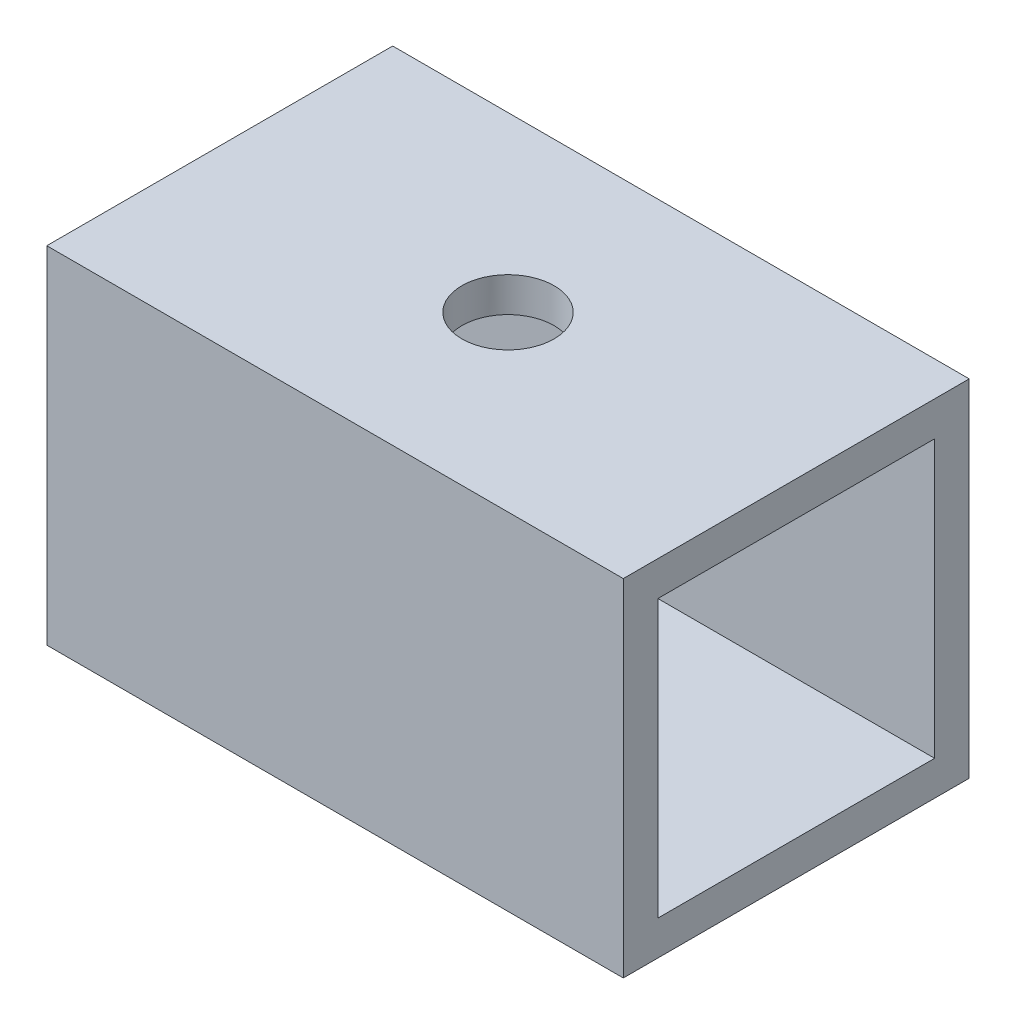
ISO-10303-21;
HEADER;
FILE_DESCRIPTION(('STEP AP214'),'2;1');
FILE_NAME('part.step','',(''),(''),'','','');
FILE_SCHEMA(('AUTOMOTIVE_DESIGN { 1 0 10303 214 1 1 1 1 }'));
ENDSEC;
DATA;
#1=APPLICATION_CONTEXT('core data for automotive mechanical design processes');
#2=APPLICATION_PROTOCOL_DEFINITION('international standard','automotive_design',2000,#1);
#3=PRODUCT_CONTEXT('',#1,'mechanical');
#4=PRODUCT('Part','Part','',(#3));
#5=PRODUCT_RELATED_PRODUCT_CATEGORY('part','',(#4));
#6=PRODUCT_DEFINITION_FORMATION('','',#4);
#7=PRODUCT_DEFINITION_CONTEXT('part definition',#1,'design');
#8=PRODUCT_DEFINITION('design','',#6,#7);
#9=PRODUCT_DEFINITION_SHAPE('','',#8);
#10=(LENGTH_UNIT() NAMED_UNIT(*) SI_UNIT(.MILLI.,.METRE.));
#11=(NAMED_UNIT(*) PLANE_ANGLE_UNIT() SI_UNIT($,.RADIAN.));
#12=(NAMED_UNIT(*) SI_UNIT($,.STERADIAN.) SOLID_ANGLE_UNIT());
#13=UNCERTAINTY_MEASURE_WITH_UNIT(LENGTH_MEASURE(1.E-05),#10,'distance_accuracy_value','');
#14=(GEOMETRIC_REPRESENTATION_CONTEXT(3) GLOBAL_UNCERTAINTY_ASSIGNED_CONTEXT((#13)) GLOBAL_UNIT_ASSIGNED_CONTEXT((#10,
#11,#12)) REPRESENTATION_CONTEXT('',''));
#15=CARTESIAN_POINT('',(0.,0.,0.));
#16=DIRECTION('',(0.,0.,1.));
#17=DIRECTION('',(1.,0.,0.));
#18=AXIS2_PLACEMENT_3D('',#15,#16,#17);
#19=CARTESIAN_POINT('',(25.,0.,0.));
#20=DIRECTION('',(1.,0.,0.));
#21=DIRECTION('',(0.,0.,-1.));
#22=AXIS2_PLACEMENT_3D('',#19,#20,#21);
#23=PLANE('',#22);
#24=DIRECTION('',(0.,1.,0.));
#25=VECTOR('',#24,1.);
#26=CARTESIAN_POINT('',(25.,7.5,-7.5));
#27=LINE('',#26,#25);
#28=CARTESIAN_POINT('',(25.,-7.5,-7.5));
#29=VERTEX_POINT('',#28);
#30=CARTESIAN_POINT('',(25.,7.5,-7.5));
#31=VERTEX_POINT('',#30);
#32=EDGE_CURVE('E137',#29,#31,#27,.T.);
#33=ORIENTED_EDGE('',*,*,#32,.T.);
#34=DIRECTION('',(0.,0.,1.));
#35=VECTOR('',#34,1.);
#36=CARTESIAN_POINT('',(25.,7.5,7.5));
#37=LINE('',#36,#35);
#38=CARTESIAN_POINT('',(25.,7.5,7.5));
#39=VERTEX_POINT('',#38);
#40=EDGE_CURVE('E140',#31,#39,#37,.T.);
#41=ORIENTED_EDGE('',*,*,#40,.T.);
#42=DIRECTION('',(0.,-1.,0.));
#43=VECTOR('',#42,1.);
#44=CARTESIAN_POINT('',(25.,7.5,7.5));
#45=LINE('',#44,#43);
#46=CARTESIAN_POINT('',(25.,-7.5,7.5));
#47=VERTEX_POINT('',#46);
#48=EDGE_CURVE('E143',#39,#47,#45,.T.);
#49=ORIENTED_EDGE('',*,*,#48,.T.);
#50=DIRECTION('',(0.,0.,-1.));
#51=VECTOR('',#50,1.);
#52=CARTESIAN_POINT('',(25.,-7.5,7.5));
#53=LINE('',#52,#51);
#54=EDGE_CURVE('E145',#47,#29,#53,.T.);
#55=ORIENTED_EDGE('',*,*,#54,.T.);
#56=EDGE_LOOP('',(#33,#41,#49,#55));
#57=FACE_BOUND('',#56,.T.);
#58=DIRECTION('',(0.,0.,-1.));
#59=VECTOR('',#58,1.);
#60=CARTESIAN_POINT('',(25.,-6.,6.));
#61=LINE('',#60,#59);
#62=CARTESIAN_POINT('',(25.,-6.,6.));
#63=VERTEX_POINT('',#62);
#64=CARTESIAN_POINT('',(25.,-6.,-6.));
#65=VERTEX_POINT('',#64);
#66=EDGE_CURVE('E107',#63,#65,#61,.T.);
#67=ORIENTED_EDGE('',*,*,#66,.F.);
#68=DIRECTION('',(0.,-1.,0.));
#69=VECTOR('',#68,1.);
#70=CARTESIAN_POINT('',(25.,6.,6.));
#71=LINE('',#70,#69);
#72=CARTESIAN_POINT('',(25.,6.,6.));
#73=VERTEX_POINT('',#72);
#74=EDGE_CURVE('E99',#73,#63,#71,.T.);
#75=ORIENTED_EDGE('',*,*,#74,.F.);
#76=DIRECTION('',(0.,0.,1.));
#77=VECTOR('',#76,1.);
#78=CARTESIAN_POINT('',(25.,6.,6.));
#79=LINE('',#78,#77);
#80=CARTESIAN_POINT('',(25.,6.,-6.));
#81=VERTEX_POINT('',#80);
#82=EDGE_CURVE('E121',#81,#73,#79,.T.);
#83=ORIENTED_EDGE('',*,*,#82,.F.);
#84=DIRECTION('',(0.,1.,0.));
#85=VECTOR('',#84,1.);
#86=CARTESIAN_POINT('',(25.,6.,-6.));
#87=LINE('',#86,#85);
#88=EDGE_CURVE('E119',#65,#81,#87,.T.);
#89=ORIENTED_EDGE('',*,*,#88,.F.);
#90=EDGE_LOOP('',(#67,#75,#83,#89));
#91=FACE_BOUND('',#90,.T.);
#92=ADVANCED_FACE('F33',(#57,#91),#23,.T.);
#93=CARTESIAN_POINT('',(0.,0.,0.));
#94=DIRECTION('',(1.,0.,0.));
#95=DIRECTION('',(0.,0.,-1.));
#96=AXIS2_PLACEMENT_3D('',#93,#94,#95);
#97=PLANE('',#96);
#98=DIRECTION('',(0.,1.,0.));
#99=VECTOR('',#98,1.);
#100=CARTESIAN_POINT('',(0.,7.5,-7.5));
#101=LINE('',#100,#99);
#102=CARTESIAN_POINT('',(0.,-7.5,-7.5));
#103=VERTEX_POINT('',#102);
#104=CARTESIAN_POINT('',(0.,7.5,-7.5));
#105=VERTEX_POINT('',#104);
#106=EDGE_CURVE('E115',#103,#105,#101,.T.);
#107=ORIENTED_EDGE('',*,*,#106,.F.);
#108=DIRECTION('',(0.,0.,-1.));
#109=VECTOR('',#108,1.);
#110=CARTESIAN_POINT('',(0.,-7.5,7.5));
#111=LINE('',#110,#109);
#112=CARTESIAN_POINT('',(0.,-7.5,7.5));
#113=VERTEX_POINT('',#112);
#114=EDGE_CURVE('E141',#113,#103,#111,.T.);
#115=ORIENTED_EDGE('',*,*,#114,.F.);
#116=DIRECTION('',(0.,-1.,0.));
#117=VECTOR('',#116,1.);
#118=CARTESIAN_POINT('',(0.,7.5,7.5));
#119=LINE('',#118,#117);
#120=CARTESIAN_POINT('',(0.,7.5,7.5));
#121=VERTEX_POINT('',#120);
#122=EDGE_CURVE('E152',#121,#113,#119,.T.);
#123=ORIENTED_EDGE('',*,*,#122,.F.);
#124=DIRECTION('',(0.,0.,1.));
#125=VECTOR('',#124,1.);
#126=CARTESIAN_POINT('',(0.,7.5,7.5));
#127=LINE('',#126,#125);
#128=EDGE_CURVE('E150',#105,#121,#127,.T.);
#129=ORIENTED_EDGE('',*,*,#128,.F.);
#130=EDGE_LOOP('',(#107,#115,#123,#129));
#131=FACE_BOUND('',#130,.T.);
#132=DIRECTION('',(0.,-1.,0.));
#133=VECTOR('',#132,1.);
#134=CARTESIAN_POINT('',(0.,6.,6.));
#135=LINE('',#134,#133);
#136=CARTESIAN_POINT('',(0.,6.,6.));
#137=VERTEX_POINT('',#136);
#138=CARTESIAN_POINT('',(0.,-6.,6.));
#139=VERTEX_POINT('',#138);
#140=EDGE_CURVE('E57',#137,#139,#135,.T.);
#141=ORIENTED_EDGE('',*,*,#140,.T.);
#142=DIRECTION('',(0.,0.,-1.));
#143=VECTOR('',#142,1.);
#144=CARTESIAN_POINT('',(0.,-6.,6.));
#145=LINE('',#144,#143);
#146=CARTESIAN_POINT('',(0.,-6.,-6.));
#147=VERTEX_POINT('',#146);
#148=EDGE_CURVE('E114',#139,#147,#145,.T.);
#149=ORIENTED_EDGE('',*,*,#148,.T.);
#150=DIRECTION('',(0.,1.,0.));
#151=VECTOR('',#150,1.);
#152=CARTESIAN_POINT('',(0.,6.,-6.));
#153=LINE('',#152,#151);
#154=CARTESIAN_POINT('',(0.,6.,-6.));
#155=VERTEX_POINT('',#154);
#156=EDGE_CURVE('E129',#147,#155,#153,.T.);
#157=ORIENTED_EDGE('',*,*,#156,.T.);
#158=DIRECTION('',(0.,0.,1.));
#159=VECTOR('',#158,1.);
#160=CARTESIAN_POINT('',(0.,6.,6.));
#161=LINE('',#160,#159);
#162=EDGE_CURVE('E108',#155,#137,#161,.T.);
#163=ORIENTED_EDGE('',*,*,#162,.T.);
#164=EDGE_LOOP('',(#141,#149,#157,#163));
#165=FACE_BOUND('',#164,.T.);
#166=ADVANCED_FACE('F171',(#131,#165),#97,.F.);
#167=CARTESIAN_POINT('',(25.,7.5,-7.5));
#168=DIRECTION('',(0.,0.,1.));
#169=DIRECTION('',(0.,-1.,0.));
#170=AXIS2_PLACEMENT_3D('',#167,#168,#169);
#171=PLANE('',#170);
#172=ORIENTED_EDGE('',*,*,#106,.T.);
#173=DIRECTION('',(-1.,0.,0.));
#174=VECTOR('',#173,1.);
#175=CARTESIAN_POINT('',(25.,7.5,-7.5));
#176=LINE('',#175,#174);
#177=EDGE_CURVE('E11',#31,#105,#176,.T.);
#178=ORIENTED_EDGE('',*,*,#177,.F.);
#179=ORIENTED_EDGE('',*,*,#32,.F.);
#180=DIRECTION('',(-1.,0.,0.));
#181=VECTOR('',#180,1.);
#182=CARTESIAN_POINT('',(25.,-7.5,-7.5));
#183=LINE('',#182,#181);
#184=EDGE_CURVE('E147',#29,#103,#183,.T.);
#185=ORIENTED_EDGE('',*,*,#184,.T.);
#186=EDGE_LOOP('',(#172,#178,#179,#185));
#187=FACE_BOUND('',#186,.T.);
#188=ADVANCED_FACE('F35',(#187),#171,.F.);
#189=CARTESIAN_POINT('',(25.,7.5,7.5));
#190=DIRECTION('',(0.,-1.,0.));
#191=DIRECTION('',(0.,0.,-1.));
#192=AXIS2_PLACEMENT_3D('',#189,#190,#191);
#193=PLANE('',#192);
#194=CARTESIAN_POINT('',(12.5,7.5,0.));
#195=DIRECTION('',(0.,1.,0.));
#196=DIRECTION('',(0.,0.,1.));
#197=AXIS2_PLACEMENT_3D('',#194,#195,#196);
#198=CIRCLE('',#197,2.);
#199=CARTESIAN_POINT('',(12.5,7.5,2.));
#200=VERTEX_POINT('',#199);
#201=EDGE_CURVE('E208',#200,#200,#198,.T.);
#202=ORIENTED_EDGE('',*,*,#201,.F.);
#203=EDGE_LOOP('',(#202));
#204=FACE_BOUND('',#203,.T.);
#205=ORIENTED_EDGE('',*,*,#128,.T.);
#206=DIRECTION('',(-1.,0.,0.));
#207=VECTOR('',#206,1.);
#208=CARTESIAN_POINT('',(25.,7.5,7.5));
#209=LINE('',#208,#207);
#210=EDGE_CURVE('E42',#39,#121,#209,.T.);
#211=ORIENTED_EDGE('',*,*,#210,.F.);
#212=ORIENTED_EDGE('',*,*,#40,.F.);
#213=ORIENTED_EDGE('',*,*,#177,.T.);
#214=EDGE_LOOP('',(#205,#211,#212,#213));
#215=FACE_BOUND('',#214,.T.);
#216=ADVANCED_FACE('F181',(#204,#215),#193,.F.);
#217=CARTESIAN_POINT('',(25.,7.5,7.5));
#218=DIRECTION('',(0.,0.,-1.));
#219=DIRECTION('',(0.,1.,0.));
#220=AXIS2_PLACEMENT_3D('',#217,#218,#219);
#221=PLANE('',#220);
#222=ORIENTED_EDGE('',*,*,#122,.T.);
#223=DIRECTION('',(-1.,0.,0.));
#224=VECTOR('',#223,1.);
#225=CARTESIAN_POINT('',(25.,-7.5,7.5));
#226=LINE('',#225,#224);
#227=EDGE_CURVE('E157',#47,#113,#226,.T.);
#228=ORIENTED_EDGE('',*,*,#227,.F.);
#229=ORIENTED_EDGE('',*,*,#48,.F.);
#230=ORIENTED_EDGE('',*,*,#210,.T.);
#231=EDGE_LOOP('',(#222,#228,#229,#230));
#232=FACE_BOUND('',#231,.T.);
#233=ADVANCED_FACE('F165',(#232),#221,.F.);
#234=CARTESIAN_POINT('',(25.,-7.5,7.5));
#235=DIRECTION('',(0.,1.,0.));
#236=DIRECTION('',(0.,0.,1.));
#237=AXIS2_PLACEMENT_3D('',#234,#235,#236);
#238=PLANE('',#237);
#239=CARTESIAN_POINT('',(12.5,-7.5,0.));
#240=DIRECTION('',(0.,1.,0.));
#241=DIRECTION('',(0.,0.,1.));
#242=AXIS2_PLACEMENT_3D('',#239,#240,#241);
#243=CIRCLE('',#242,2.);
#244=CARTESIAN_POINT('',(12.5,-7.5,2.));
#245=VERTEX_POINT('',#244);
#246=EDGE_CURVE('E206',#245,#245,#243,.T.);
#247=ORIENTED_EDGE('',*,*,#246,.T.);
#248=EDGE_LOOP('',(#247));
#249=FACE_BOUND('',#248,.T.);
#250=ORIENTED_EDGE('',*,*,#114,.T.);
#251=ORIENTED_EDGE('',*,*,#184,.F.);
#252=ORIENTED_EDGE('',*,*,#54,.F.);
#253=ORIENTED_EDGE('',*,*,#227,.T.);
#254=EDGE_LOOP('',(#250,#251,#252,#253));
#255=FACE_BOUND('',#254,.T.);
#256=ADVANCED_FACE('F175',(#249,#255),#238,.F.);
#257=CARTESIAN_POINT('',(25.,6.,6.));
#258=DIRECTION('',(0.,0.,-1.));
#259=DIRECTION('',(0.,1.,0.));
#260=AXIS2_PLACEMENT_3D('',#257,#258,#259);
#261=PLANE('',#260);
#262=ORIENTED_EDGE('',*,*,#140,.F.);
#263=DIRECTION('',(-1.,0.,0.));
#264=VECTOR('',#263,1.);
#265=CARTESIAN_POINT('',(25.,6.,6.));
#266=LINE('',#265,#264);
#267=EDGE_CURVE('E103',#73,#137,#266,.T.);
#268=ORIENTED_EDGE('',*,*,#267,.F.);
#269=ORIENTED_EDGE('',*,*,#74,.T.);
#270=DIRECTION('',(-1.,0.,0.));
#271=VECTOR('',#270,1.);
#272=CARTESIAN_POINT('',(25.,-6.,6.));
#273=LINE('',#272,#271);
#274=EDGE_CURVE('E102',#63,#139,#273,.T.);
#275=ORIENTED_EDGE('',*,*,#274,.T.);
#276=EDGE_LOOP('',(#262,#268,#269,#275));
#277=FACE_BOUND('',#276,.T.);
#278=ADVANCED_FACE('F101',(#277),#261,.T.);
#279=CARTESIAN_POINT('',(25.,-6.,6.));
#280=DIRECTION('',(0.,1.,0.));
#281=DIRECTION('',(0.,0.,1.));
#282=AXIS2_PLACEMENT_3D('',#279,#280,#281);
#283=PLANE('',#282);
#284=CARTESIAN_POINT('',(12.5,-6.,0.));
#285=DIRECTION('',(0.,1.,0.));
#286=DIRECTION('',(0.,0.,1.));
#287=AXIS2_PLACEMENT_3D('',#284,#285,#286);
#288=CIRCLE('',#287,2.);
#289=CARTESIAN_POINT('',(12.5,-6.,2.));
#290=VERTEX_POINT('',#289);
#291=EDGE_CURVE('E127',#290,#290,#288,.T.);
#292=ORIENTED_EDGE('',*,*,#291,.F.);
#293=EDGE_LOOP('',(#292));
#294=FACE_BOUND('',#293,.T.);
#295=ORIENTED_EDGE('',*,*,#148,.F.);
#296=ORIENTED_EDGE('',*,*,#274,.F.);
#297=ORIENTED_EDGE('',*,*,#66,.T.);
#298=DIRECTION('',(-1.,0.,0.));
#299=VECTOR('',#298,1.);
#300=CARTESIAN_POINT('',(25.,-6.,-6.));
#301=LINE('',#300,#299);
#302=EDGE_CURVE('E116',#65,#147,#301,.T.);
#303=ORIENTED_EDGE('',*,*,#302,.T.);
#304=EDGE_LOOP('',(#295,#296,#297,#303));
#305=FACE_BOUND('',#304,.T.);
#306=ADVANCED_FACE('F111',(#294,#305),#283,.T.);
#307=CARTESIAN_POINT('',(25.,6.,-6.));
#308=DIRECTION('',(0.,0.,1.));
#309=DIRECTION('',(0.,-1.,0.));
#310=AXIS2_PLACEMENT_3D('',#307,#308,#309);
#311=PLANE('',#310);
#312=ORIENTED_EDGE('',*,*,#156,.F.);
#313=ORIENTED_EDGE('',*,*,#302,.F.);
#314=ORIENTED_EDGE('',*,*,#88,.T.);
#315=DIRECTION('',(-1.,0.,0.));
#316=VECTOR('',#315,1.);
#317=CARTESIAN_POINT('',(25.,6.,-6.));
#318=LINE('',#317,#316);
#319=EDGE_CURVE('E49',#81,#155,#318,.T.);
#320=ORIENTED_EDGE('',*,*,#319,.T.);
#321=EDGE_LOOP('',(#312,#313,#314,#320));
#322=FACE_BOUND('',#321,.T.);
#323=ADVANCED_FACE('F219',(#322),#311,.T.);
#324=CARTESIAN_POINT('',(25.,6.,6.));
#325=DIRECTION('',(0.,-1.,0.));
#326=DIRECTION('',(0.,0.,-1.));
#327=AXIS2_PLACEMENT_3D('',#324,#325,#326);
#328=PLANE('',#327);
#329=CARTESIAN_POINT('',(12.5,6.,0.));
#330=DIRECTION('',(0.,-1.,0.));
#331=DIRECTION('',(0.,0.,-1.));
#332=AXIS2_PLACEMENT_3D('',#329,#330,#331);
#333=CIRCLE('',#332,2.);
#334=CARTESIAN_POINT('',(12.5,6.,-2.));
#335=VERTEX_POINT('',#334);
#336=EDGE_CURVE('E37',#335,#335,#333,.T.);
#337=ORIENTED_EDGE('',*,*,#336,.F.);
#338=EDGE_LOOP('',(#337));
#339=FACE_BOUND('',#338,.T.);
#340=ORIENTED_EDGE('',*,*,#162,.F.);
#341=ORIENTED_EDGE('',*,*,#319,.F.);
#342=ORIENTED_EDGE('',*,*,#82,.T.);
#343=ORIENTED_EDGE('',*,*,#267,.T.);
#344=EDGE_LOOP('',(#340,#341,#342,#343));
#345=FACE_BOUND('',#344,.T.);
#346=ADVANCED_FACE('F223',(#339,#345),#328,.T.);
#347=CARTESIAN_POINT('',(12.5,-7.5,0.));
#348=DIRECTION('',(0.,1.,0.));
#349=DIRECTION('',(0.,0.,1.));
#350=AXIS2_PLACEMENT_3D('',#347,#348,#349);
#351=CYLINDRICAL_SURFACE('',#350,2.);
#352=ORIENTED_EDGE('',*,*,#336,.T.);
#353=EDGE_LOOP('',(#352));
#354=FACE_BOUND('',#353,.T.);
#355=ORIENTED_EDGE('',*,*,#201,.T.);
#356=EDGE_LOOP('',(#355));
#357=FACE_BOUND('',#356,.T.);
#358=ADVANCED_FACE('F229',(#354,#357),#351,.F.);
#359=ORIENTED_EDGE('',*,*,#291,.T.);
#360=EDGE_LOOP('',(#359));
#361=FACE_BOUND('',#360,.T.);
#362=ORIENTED_EDGE('',*,*,#246,.F.);
#363=EDGE_LOOP('',(#362));
#364=FACE_BOUND('',#363,.T.);
#365=ADVANCED_FACE('F216',(#361,#364),#351,.F.);
#366=CLOSED_SHELL('',(#92,#166,#188,#216,#233,#256,#278,#306,#323,#346,#358,#365));
#367=MANIFOLD_SOLID_BREP('B2',#366);
#368=ADVANCED_BREP_SHAPE_REPRESENTATION('',(#18,#367),#14);
#369=SHAPE_DEFINITION_REPRESENTATION(#9,#368);
ENDSEC;
END-ISO-10303-21;
